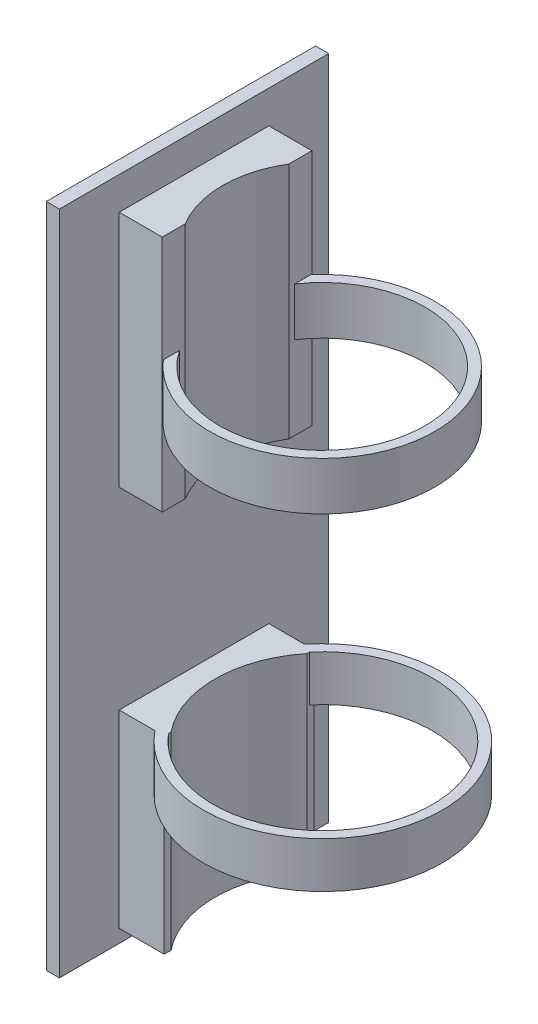
ISO-10303-21;
HEADER;
FILE_DESCRIPTION(('STEP AP214'),'2;1');
FILE_NAME('part.step','',(''),(''),'','','');
FILE_SCHEMA(('AUTOMOTIVE_DESIGN { 1 0 10303 214 1 1 1 1 }'));
ENDSEC;
DATA;
#1=APPLICATION_CONTEXT('core data for automotive mechanical design processes');
#2=APPLICATION_PROTOCOL_DEFINITION('international standard','automotive_design',2000,#1);
#3=PRODUCT_CONTEXT('',#1,'mechanical');
#4=PRODUCT('Part','Part','',(#3));
#5=PRODUCT_RELATED_PRODUCT_CATEGORY('part','',(#4));
#6=PRODUCT_DEFINITION_FORMATION('','',#4);
#7=PRODUCT_DEFINITION_CONTEXT('part definition',#1,'design');
#8=PRODUCT_DEFINITION('design','',#6,#7);
#9=PRODUCT_DEFINITION_SHAPE('','',#8);
#10=(LENGTH_UNIT() NAMED_UNIT(*) SI_UNIT(.MILLI.,.METRE.));
#11=(NAMED_UNIT(*) PLANE_ANGLE_UNIT() SI_UNIT($,.RADIAN.));
#12=(NAMED_UNIT(*) SI_UNIT($,.STERADIAN.) SOLID_ANGLE_UNIT());
#13=UNCERTAINTY_MEASURE_WITH_UNIT(LENGTH_MEASURE(1.E-05),#10,'distance_accuracy_value','');
#14=(GEOMETRIC_REPRESENTATION_CONTEXT(3) GLOBAL_UNCERTAINTY_ASSIGNED_CONTEXT((#13)) GLOBAL_UNIT_ASSIGNED_CONTEXT((#10,
#11,#12)) REPRESENTATION_CONTEXT('',''));
#15=CARTESIAN_POINT('',(0.,0.,0.));
#16=DIRECTION('',(0.,0.,1.));
#17=DIRECTION('',(1.,0.,0.));
#18=AXIS2_PLACEMENT_3D('',#15,#16,#17);
#19=CARTESIAN_POINT('',(-28.6071268948191,0.,11.43));
#20=DIRECTION('',(-1.,0.,0.));
#21=DIRECTION('',(0.,0.,1.));
#22=AXIS2_PLACEMENT_3D('',#19,#20,#21);
#23=PLANE('',#22);
#24=DIRECTION('',(0.,0.,-1.));
#25=VECTOR('',#24,1.);
#26=CARTESIAN_POINT('',(-28.6071268948191,-2.80236584326087,11.43));
#27=LINE('',#26,#25);
#28=CARTESIAN_POINT('',(-28.6071268948191,-2.80236584326087,11.43));
#29=VERTEX_POINT('',#28);
#30=CARTESIAN_POINT('',(-28.6071268948191,-2.80236584326087,10.7807490814345));
#31=VERTEX_POINT('',#30);
#32=EDGE_CURVE('E262',#29,#31,#27,.T.);
#33=ORIENTED_EDGE('',*,*,#32,.F.);
#34=DIRECTION('',(0.,1.,0.));
#35=VECTOR('',#34,1.);
#36=CARTESIAN_POINT('',(-28.6071268948191,0.,11.43));
#37=LINE('',#36,#35);
#38=CARTESIAN_POINT('',(-28.6071268948191,-24.6959497812609,11.43));
#39=VERTEX_POINT('',#38);
#40=EDGE_CURVE('E371',#39,#29,#37,.T.);
#41=ORIENTED_EDGE('',*,*,#40,.F.);
#42=DIRECTION('',(0.,0.,-1.));
#43=VECTOR('',#42,1.);
#44=CARTESIAN_POINT('',(-28.6071268948191,-24.6959497812609,11.43));
#45=LINE('',#44,#43);
#46=CARTESIAN_POINT('',(-28.6071268948191,-24.6959497812609,10.3709124643341));
#47=VERTEX_POINT('',#46);
#48=EDGE_CURVE('E224',#39,#47,#45,.T.);
#49=ORIENTED_EDGE('',*,*,#48,.T.);
#50=DIRECTION('',(0.,-1.,0.));
#51=VECTOR('',#50,1.);
#52=CARTESIAN_POINT('',(-28.6071268948191,75.0679178019088,10.3709124643341));
#53=LINE('',#52,#51);
#54=CARTESIAN_POINT('',(-28.6071268948191,4.19763415673913,10.3709124643341));
#55=VERTEX_POINT('',#54);
#56=EDGE_CURVE('E221',#55,#47,#53,.T.);
#57=ORIENTED_EDGE('',*,*,#56,.F.);
#58=DIRECTION('',(0.,0.,-1.));
#59=VECTOR('',#58,1.);
#60=CARTESIAN_POINT('',(-28.6071268948191,4.19763415673913,11.43));
#61=LINE('',#60,#59);
#62=CARTESIAN_POINT('',(-28.6071268948191,4.19763415673913,10.7807490814345));
#63=VERTEX_POINT('',#62);
#64=EDGE_CURVE('E215',#63,#55,#61,.T.);
#65=ORIENTED_EDGE('',*,*,#64,.F.);
#66=DIRECTION('',(0.,1.,0.));
#67=VECTOR('',#66,1.);
#68=CARTESIAN_POINT('',(-28.6071268948191,-2.80236584326087,10.7807490814345));
#69=LINE('',#68,#67);
#70=EDGE_CURVE('E200',#31,#63,#69,.T.);
#71=ORIENTED_EDGE('',*,*,#70,.F.);
#72=EDGE_LOOP('',(#33,#41,#49,#57,#65,#71));
#73=FACE_BOUND('',#72,.T.);
#74=ADVANCED_FACE('F39',(#73),#23,.F.);
#75=DIRECTION('',(0.,0.,-1.));
#76=VECTOR('',#75,1.);
#77=CARTESIAN_POINT('',(-28.6071268948191,-2.80236584326087,11.43));
#78=LINE('',#77,#76);
#79=CARTESIAN_POINT('',(-28.6071268948191,-2.80236584326087,-10.7807490814345));
#80=VERTEX_POINT('',#79);
#81=CARTESIAN_POINT('',(-28.6071268948191,-2.80236584326087,-11.43));
#82=VERTEX_POINT('',#81);
#83=EDGE_CURVE('E54',#80,#82,#78,.T.);
#84=ORIENTED_EDGE('',*,*,#83,.F.);
#85=DIRECTION('',(0.,1.,0.));
#86=VECTOR('',#85,1.);
#87=CARTESIAN_POINT('',(-28.6071268948191,-2.80236584326087,-10.7807490814345));
#88=LINE('',#87,#86);
#89=CARTESIAN_POINT('',(-28.6071268948191,4.19763415673913,-10.7807490814345));
#90=VERTEX_POINT('',#89);
#91=EDGE_CURVE('E58',#90,#80,#88,.F.);
#92=ORIENTED_EDGE('',*,*,#91,.F.);
#93=CARTESIAN_POINT('',(-28.6071268948191,4.19763415673913,-10.3709124643341));
#94=VERTEX_POINT('',#93);
#95=EDGE_CURVE('E217',#94,#90,#61,.T.);
#96=ORIENTED_EDGE('',*,*,#95,.F.);
#97=DIRECTION('',(0.,-1.,0.));
#98=VECTOR('',#97,1.);
#99=CARTESIAN_POINT('',(-28.6071268948191,75.0679178019088,-10.3709124643341));
#100=LINE('',#99,#98);
#101=CARTESIAN_POINT('',(-28.6071268948191,-24.6959497812609,-10.3709124643341));
#102=VERTEX_POINT('',#101);
#103=EDGE_CURVE('E297',#102,#94,#100,.F.);
#104=ORIENTED_EDGE('',*,*,#103,.F.);
#105=CARTESIAN_POINT('',(-28.6071268948191,-24.6959497812609,-11.43));
#106=VERTEX_POINT('',#105);
#107=EDGE_CURVE('E222',#102,#106,#45,.T.);
#108=ORIENTED_EDGE('',*,*,#107,.T.);
#109=DIRECTION('',(0.,1.,0.));
#110=VECTOR('',#109,1.);
#111=CARTESIAN_POINT('',(-28.6071268948191,0.,-11.43));
#112=LINE('',#111,#110);
#113=EDGE_CURVE('E384',#106,#82,#112,.T.);
#114=ORIENTED_EDGE('',*,*,#113,.T.);
#115=EDGE_LOOP('',(#84,#92,#96,#104,#108,#114));
#116=FACE_BOUND('',#115,.T.);
#117=ADVANCED_FACE('F407',(#116),#23,.F.);
#118=CARTESIAN_POINT('',(-28.9024604068047,0.,11.43));
#119=DIRECTION('',(-1.,0.,0.));
#120=DIRECTION('',(0.,0.,1.));
#121=AXIS2_PLACEMENT_3D('',#118,#119,#120);
#122=PLANE('',#121);
#123=DIRECTION('',(0.,0.,1.));
#124=VECTOR('',#123,1.);
#125=CARTESIAN_POINT('',(-28.9024604068047,53.7453987122624,11.43));
#126=LINE('',#125,#124);
#127=CARTESIAN_POINT('',(-28.9024604068047,53.7453987122624,-11.2636945327213));
#128=VERTEX_POINT('',#127);
#129=CARTESIAN_POINT('',(-28.9024604068047,53.7453987122624,-8.80203466980536));
#130=VERTEX_POINT('',#129);
#131=EDGE_CURVE('E282',#128,#130,#126,.T.);
#132=ORIENTED_EDGE('',*,*,#131,.F.);
#133=DIRECTION('',(0.,-1.,0.));
#134=VECTOR('',#133,1.);
#135=CARTESIAN_POINT('',(-28.9024604068047,53.7453987122624,-11.2636945327213));
#136=LINE('',#135,#134);
#137=CARTESIAN_POINT('',(-28.9024604068047,46.3793987122623,-11.2636945327213));
#138=VERTEX_POINT('',#137);
#139=EDGE_CURVE('E285',#128,#138,#136,.T.);
#140=ORIENTED_EDGE('',*,*,#139,.T.);
#141=DIRECTION('',(0.,0.,1.));
#142=VECTOR('',#141,1.);
#143=CARTESIAN_POINT('',(-28.9024604068047,46.3793987122623,11.43));
#144=LINE('',#143,#142);
#145=CARTESIAN_POINT('',(-28.9024604068047,46.3793987122623,-8.80203466980536));
#146=VERTEX_POINT('',#145);
#147=EDGE_CURVE('E280',#138,#146,#144,.T.);
#148=ORIENTED_EDGE('',*,*,#147,.T.);
#149=DIRECTION('',(0.,-1.,0.));
#150=VECTOR('',#149,1.);
#151=CARTESIAN_POINT('',(-28.9024604068047,53.7453987122624,-8.80203466980536));
#152=LINE('',#151,#150);
#153=EDGE_CURVE('E275',#130,#146,#152,.T.);
#154=ORIENTED_EDGE('',*,*,#153,.F.);
#155=EDGE_LOOP('',(#132,#140,#148,#154));
#156=FACE_BOUND('',#155,.T.);
#157=DIRECTION('',(0.,0.,-1.));
#158=VECTOR('',#157,1.);
#159=CARTESIAN_POINT('',(-28.9024604068047,70.0669178019088,11.43));
#160=LINE('',#159,#158);
#161=CARTESIAN_POINT('',(-28.9024604068047,70.0669178019088,-7.92289008216544));
#162=VERTEX_POINT('',#161);
#163=CARTESIAN_POINT('',(-28.9024604068047,70.0669178019088,-11.43));
#164=VERTEX_POINT('',#163);
#165=EDGE_CURVE('E330',#162,#164,#160,.T.);
#166=ORIENTED_EDGE('',*,*,#165,.F.);
#167=DIRECTION('',(0.,-1.,0.));
#168=VECTOR('',#167,1.);
#169=CARTESIAN_POINT('',(-28.9024604068047,75.0679178019088,-7.92289008216544));
#170=LINE('',#169,#168);
#171=CARTESIAN_POINT('',(-28.9024604068047,33.6793987122623,-7.92289008216544));
#172=VERTEX_POINT('',#171);
#173=EDGE_CURVE('E289',#172,#162,#170,.F.);
#174=ORIENTED_EDGE('',*,*,#173,.F.);
#175=DIRECTION('',(0.,0.,-1.));
#176=VECTOR('',#175,1.);
#177=CARTESIAN_POINT('',(-28.9024604068047,33.6793987122623,11.43));
#178=LINE('',#177,#176);
#179=CARTESIAN_POINT('',(-28.9024604068047,33.6793987122623,-11.43));
#180=VERTEX_POINT('',#179);
#181=EDGE_CURVE('E334',#172,#180,#178,.T.);
#182=ORIENTED_EDGE('',*,*,#181,.T.);
#183=DIRECTION('',(0.,1.,0.));
#184=VECTOR('',#183,1.);
#185=CARTESIAN_POINT('',(-28.9024604068047,0.,-11.43));
#186=LINE('',#185,#184);
#187=EDGE_CURVE('E318',#180,#164,#186,.T.);
#188=ORIENTED_EDGE('',*,*,#187,.T.);
#189=EDGE_LOOP('',(#166,#174,#182,#188));
#190=FACE_BOUND('',#189,.T.);
#191=ADVANCED_FACE('F424',(#156,#190),#122,.F.);
#192=CARTESIAN_POINT('',(0.,-24.6959497812609,11.43));
#193=DIRECTION('',(0.,1.,0.));
#194=DIRECTION('',(0.,0.,1.));
#195=AXIS2_PLACEMENT_3D('',#192,#193,#194);
#196=PLANE('',#195);
#197=CARTESIAN_POINT('',(-15.7738040726846,-24.6959497812609,0.));
#198=DIRECTION('',(0.,1.,0.));
#199=DIRECTION('',(0.,0.,1.));
#200=AXIS2_PLACEMENT_3D('',#197,#198,#199);
#201=CIRCLE('',#200,16.5);
#202=EDGE_CURVE('E301',#47,#102,#201,.F.);
#203=ORIENTED_EDGE('',*,*,#202,.F.);
#204=ORIENTED_EDGE('',*,*,#48,.F.);
#205=DIRECTION('',(1.,0.,0.));
#206=VECTOR('',#205,1.);
#207=CARTESIAN_POINT('',(0.,-24.6959497812609,11.43));
#208=LINE('',#207,#206);
#209=CARTESIAN_POINT('',(-35.4738040726846,-24.6959497812609,11.43));
#210=VERTEX_POINT('',#209);
#211=EDGE_CURVE('E368',#210,#39,#208,.T.);
#212=ORIENTED_EDGE('',*,*,#211,.F.);
#213=DIRECTION('',(0.,0.,-1.));
#214=VECTOR('',#213,1.);
#215=CARTESIAN_POINT('',(-35.4738040726846,-24.6959497812609,11.43));
#216=LINE('',#215,#214);
#217=CARTESIAN_POINT('',(-35.4738040726846,-24.6959497812609,-11.43));
#218=VERTEX_POINT('',#217);
#219=EDGE_CURVE('E381',#210,#218,#216,.T.);
#220=ORIENTED_EDGE('',*,*,#219,.T.);
#221=DIRECTION('',(1.,0.,0.));
#222=VECTOR('',#221,1.);
#223=CARTESIAN_POINT('',(0.,-24.6959497812609,-11.43));
#224=LINE('',#223,#222);
#225=EDGE_CURVE('E367',#218,#106,#224,.T.);
#226=ORIENTED_EDGE('',*,*,#225,.T.);
#227=ORIENTED_EDGE('',*,*,#107,.F.);
#228=EDGE_LOOP('',(#203,#204,#212,#220,#226,#227));
#229=FACE_BOUND('',#228,.T.);
#230=ADVANCED_FACE('F41',(#229),#196,.F.);
#231=CARTESIAN_POINT('',(0.,4.19763415673913,11.43));
#232=DIRECTION('',(0.,1.,0.));
#233=DIRECTION('',(0.,0.,1.));
#234=AXIS2_PLACEMENT_3D('',#231,#232,#233);
#235=PLANE('',#234);
#236=CARTESIAN_POINT('',(-15.7876904726846,4.19763415673913,0.));
#237=DIRECTION('',(0.,1.,0.));
#238=DIRECTION('',(0.,0.,1.));
#239=AXIS2_PLACEMENT_3D('',#236,#237,#238);
#240=CIRCLE('',#239,16.750000028);
#241=EDGE_CURVE('E203',#63,#90,#240,.T.);
#242=ORIENTED_EDGE('',*,*,#241,.F.);
#243=ORIENTED_EDGE('',*,*,#64,.T.);
#244=CARTESIAN_POINT('',(-15.7738040726846,4.19763415673913,0.));
#245=DIRECTION('',(0.,1.,0.));
#246=DIRECTION('',(0.,0.,1.));
#247=AXIS2_PLACEMENT_3D('',#244,#245,#246);
#248=CIRCLE('',#247,16.5);
#249=EDGE_CURVE('E299',#55,#94,#248,.F.);
#250=ORIENTED_EDGE('',*,*,#249,.T.);
#251=ORIENTED_EDGE('',*,*,#95,.T.);
#252=EDGE_LOOP('',(#242,#243,#250,#251));
#253=FACE_BOUND('',#252,.T.);
#254=DIRECTION('',(1.,0.,0.));
#255=VECTOR('',#254,1.);
#256=CARTESIAN_POINT('',(0.,4.19763415673913,11.43));
#257=LINE('',#256,#255);
#258=CARTESIAN_POINT('',(-35.4738040726846,4.19763415673913,11.43));
#259=VERTEX_POINT('',#258);
#260=CARTESIAN_POINT('',(-30.0150444438909,4.19763415673913,11.43));
#261=VERTEX_POINT('',#260);
#262=EDGE_CURVE('E375',#259,#261,#257,.T.);
#263=ORIENTED_EDGE('',*,*,#262,.T.);
#264=CARTESIAN_POINT('',(-15.7876904726846,4.19763415673913,0.));
#265=DIRECTION('',(0.,1.,0.));
#266=DIRECTION('',(0.,0.,1.));
#267=AXIS2_PLACEMENT_3D('',#264,#265,#266);
#268=CIRCLE('',#267,18.250000028);
#269=CARTESIAN_POINT('',(-30.0150444438909,4.19763415673913,-11.43));
#270=VERTEX_POINT('',#269);
#271=EDGE_CURVE('E254',#261,#270,#268,.T.);
#272=ORIENTED_EDGE('',*,*,#271,.T.);
#273=DIRECTION('',(1.,0.,0.));
#274=VECTOR('',#273,1.);
#275=CARTESIAN_POINT('',(0.,4.19763415673913,-11.43));
#276=LINE('',#275,#274);
#277=CARTESIAN_POINT('',(-35.4738040726846,4.19763415673913,-11.43));
#278=VERTEX_POINT('',#277);
#279=EDGE_CURVE('E386',#278,#270,#276,.T.);
#280=ORIENTED_EDGE('',*,*,#279,.F.);
#281=DIRECTION('',(0.,0.,-1.));
#282=VECTOR('',#281,1.);
#283=CARTESIAN_POINT('',(-35.4738040726846,4.19763415673913,11.43));
#284=LINE('',#283,#282);
#285=EDGE_CURVE('E226',#259,#278,#284,.T.);
#286=ORIENTED_EDGE('',*,*,#285,.F.);
#287=EDGE_LOOP('',(#263,#272,#280,#286));
#288=FACE_BOUND('',#287,.T.);
#289=ADVANCED_FACE('F212',(#253,#288),#235,.T.);
#290=CARTESIAN_POINT('',(0.,0.,11.43));
#291=DIRECTION('',(0.,0.,1.));
#292=DIRECTION('',(1.,0.,0.));
#293=AXIS2_PLACEMENT_3D('',#290,#291,#292);
#294=PLANE('',#293);
#295=DIRECTION('',(0.,1.,0.));
#296=VECTOR('',#295,1.);
#297=CARTESIAN_POINT('',(-30.0150444438909,-2.80236584326087,11.43));
#298=LINE('',#297,#296);
#299=CARTESIAN_POINT('',(-30.0150444438909,-2.80236584326087,11.43));
#300=VERTEX_POINT('',#299);
#301=EDGE_CURVE('E253',#261,#300,#298,.F.);
#302=ORIENTED_EDGE('',*,*,#301,.F.);
#303=ORIENTED_EDGE('',*,*,#262,.F.);
#304=DIRECTION('',(0.,1.,0.));
#305=VECTOR('',#304,1.);
#306=CARTESIAN_POINT('',(-35.4738040726846,0.,11.43));
#307=LINE('',#306,#305);
#308=EDGE_CURVE('E378',#210,#259,#307,.T.);
#309=ORIENTED_EDGE('',*,*,#308,.F.);
#310=ORIENTED_EDGE('',*,*,#211,.T.);
#311=ORIENTED_EDGE('',*,*,#40,.T.);
#312=DIRECTION('',(-1.,0.,0.));
#313=VECTOR('',#312,1.);
#314=CARTESIAN_POINT('',(0.,-2.80236584326087,11.43));
#315=LINE('',#314,#313);
#316=EDGE_CURVE('E256',#29,#300,#315,.T.);
#317=ORIENTED_EDGE('',*,*,#316,.T.);
#318=EDGE_LOOP('',(#302,#303,#309,#310,#311,#317));
#319=FACE_BOUND('',#318,.T.);
#320=ADVANCED_FACE('F400',(#319),#294,.T.);
#321=CARTESIAN_POINT('',(0.,0.,-11.43));
#322=DIRECTION('',(0.,0.,1.));
#323=DIRECTION('',(1.,0.,0.));
#324=AXIS2_PLACEMENT_3D('',#321,#322,#323);
#325=PLANE('',#324);
#326=ORIENTED_EDGE('',*,*,#279,.T.);
#327=DIRECTION('',(0.,1.,0.));
#328=VECTOR('',#327,1.);
#329=CARTESIAN_POINT('',(-30.0150444438909,-2.80236584326087,-11.43));
#330=LINE('',#329,#328);
#331=CARTESIAN_POINT('',(-30.0150444438909,-2.80236584326087,-11.43));
#332=VERTEX_POINT('',#331);
#333=EDGE_CURVE('E11',#270,#332,#330,.F.);
#334=ORIENTED_EDGE('',*,*,#333,.T.);
#335=DIRECTION('',(-1.,0.,0.));
#336=VECTOR('',#335,1.);
#337=CARTESIAN_POINT('',(0.,-2.80236584326087,-11.43));
#338=LINE('',#337,#336);
#339=EDGE_CURVE('E47',#82,#332,#338,.T.);
#340=ORIENTED_EDGE('',*,*,#339,.F.);
#341=ORIENTED_EDGE('',*,*,#113,.F.);
#342=ORIENTED_EDGE('',*,*,#225,.F.);
#343=DIRECTION('',(0.,1.,0.));
#344=VECTOR('',#343,1.);
#345=CARTESIAN_POINT('',(-35.4738040726846,0.,-11.43));
#346=LINE('',#345,#344);
#347=EDGE_CURVE('E372',#218,#278,#346,.T.);
#348=ORIENTED_EDGE('',*,*,#347,.T.);
#349=EDGE_LOOP('',(#326,#334,#340,#341,#342,#348));
#350=FACE_BOUND('',#349,.T.);
#351=ADVANCED_FACE('F408',(#350),#325,.F.);
#352=CARTESIAN_POINT('',(0.,-26.6959497812609,20.574));
#353=DIRECTION('',(0.,-1.,0.));
#354=DIRECTION('',(0.,0.,-1.));
#355=AXIS2_PLACEMENT_3D('',#352,#353,#354);
#356=PLANE('',#355);
#357=DIRECTION('',(-1.,0.,0.));
#358=VECTOR('',#357,1.);
#359=CARTESIAN_POINT('',(0.,-26.6959497812609,-20.574));
#360=LINE('',#359,#358);
#361=CARTESIAN_POINT('',(-35.4738040726846,-26.6959497812609,-20.574));
#362=VERTEX_POINT('',#361);
#363=CARTESIAN_POINT('',(-37.4738040726846,-26.6959497812609,-20.574));
#364=VERTEX_POINT('',#363);
#365=EDGE_CURVE('E338',#362,#364,#360,.T.);
#366=ORIENTED_EDGE('',*,*,#365,.F.);
#367=DIRECTION('',(0.,0.,-1.));
#368=VECTOR('',#367,1.);
#369=CARTESIAN_POINT('',(-35.4738040726846,-26.6959497812609,20.574));
#370=LINE('',#369,#368);
#371=CARTESIAN_POINT('',(-35.4738040726846,-26.6959497812609,20.574));
#372=VERTEX_POINT('',#371);
#373=EDGE_CURVE('E365',#372,#362,#370,.T.);
#374=ORIENTED_EDGE('',*,*,#373,.F.);
#375=DIRECTION('',(-1.,0.,0.));
#376=VECTOR('',#375,1.);
#377=CARTESIAN_POINT('',(0.,-26.6959497812609,20.574));
#378=LINE('',#377,#376);
#379=CARTESIAN_POINT('',(-37.4738040726846,-26.6959497812609,20.574));
#380=VERTEX_POINT('',#379);
#381=EDGE_CURVE('E339',#372,#380,#378,.T.);
#382=ORIENTED_EDGE('',*,*,#381,.T.);
#383=DIRECTION('',(0.,0.,-1.));
#384=VECTOR('',#383,1.);
#385=CARTESIAN_POINT('',(-37.4738040726846,-26.6959497812609,20.574));
#386=LINE('',#385,#384);
#387=EDGE_CURVE('E349',#380,#364,#386,.T.);
#388=ORIENTED_EDGE('',*,*,#387,.T.);
#389=EDGE_LOOP('',(#366,#374,#382,#388));
#390=FACE_BOUND('',#389,.T.);
#391=ADVANCED_FACE('F410',(#390),#356,.T.);
#392=CARTESIAN_POINT('',(-35.4738040726846,0.,20.574));
#393=DIRECTION('',(-1.,0.,0.));
#394=DIRECTION('',(0.,0.,1.));
#395=AXIS2_PLACEMENT_3D('',#392,#393,#394);
#396=PLANE('',#395);
#397=DIRECTION('',(0.,0.,-1.));
#398=VECTOR('',#397,1.);
#399=CARTESIAN_POINT('',(-35.4738040726846,33.6793987122623,11.43));
#400=LINE('',#399,#398);
#401=CARTESIAN_POINT('',(-35.4738040726846,33.6793987122623,11.43));
#402=VERTEX_POINT('',#401);
#403=CARTESIAN_POINT('',(-35.4738040726846,33.6793987122623,-11.43));
#404=VERTEX_POINT('',#403);
#405=EDGE_CURVE('E315',#402,#404,#400,.T.);
#406=ORIENTED_EDGE('',*,*,#405,.F.);
#407=DIRECTION('',(0.,1.,0.));
#408=VECTOR('',#407,1.);
#409=CARTESIAN_POINT('',(-35.4738040726846,0.,11.43));
#410=LINE('',#409,#408);
#411=CARTESIAN_POINT('',(-35.4738040726846,70.0669178019088,11.43));
#412=VERTEX_POINT('',#411);
#413=EDGE_CURVE('E313',#402,#412,#410,.T.);
#414=ORIENTED_EDGE('',*,*,#413,.T.);
#415=DIRECTION('',(0.,0.,-1.));
#416=VECTOR('',#415,1.);
#417=CARTESIAN_POINT('',(-35.4738040726846,70.0669178019088,11.43));
#418=LINE('',#417,#416);
#419=CARTESIAN_POINT('',(-35.4738040726846,70.0669178019088,-11.43));
#420=VERTEX_POINT('',#419);
#421=EDGE_CURVE('E328',#412,#420,#418,.T.);
#422=ORIENTED_EDGE('',*,*,#421,.T.);
#423=DIRECTION('',(0.,1.,0.));
#424=VECTOR('',#423,1.);
#425=CARTESIAN_POINT('',(-35.4738040726846,0.,-11.43));
#426=LINE('',#425,#424);
#427=EDGE_CURVE('E308',#404,#420,#426,.T.);
#428=ORIENTED_EDGE('',*,*,#427,.F.);
#429=EDGE_LOOP('',(#406,#414,#422,#428));
#430=FACE_BOUND('',#429,.T.);
#431=ORIENTED_EDGE('',*,*,#347,.F.);
#432=ORIENTED_EDGE('',*,*,#219,.F.);
#433=ORIENTED_EDGE('',*,*,#308,.T.);
#434=ORIENTED_EDGE('',*,*,#285,.T.);
#435=EDGE_LOOP('',(#431,#432,#433,#434));
#436=FACE_BOUND('',#435,.T.);
#437=DIRECTION('',(0.,1.,0.));
#438=VECTOR('',#437,1.);
#439=CARTESIAN_POINT('',(-35.4738040726846,0.,-20.574));
#440=LINE('',#439,#438);
#441=CARTESIAN_POINT('',(-35.4738040726846,75.0669178019088,-20.574));
#442=VERTEX_POINT('',#441);
#443=EDGE_CURVE('E352',#362,#442,#440,.T.);
#444=ORIENTED_EDGE('',*,*,#443,.T.);
#445=DIRECTION('',(0.,0.,-1.));
#446=VECTOR('',#445,1.);
#447=CARTESIAN_POINT('',(-35.4738040726846,75.0669178019088,20.574));
#448=LINE('',#447,#446);
#449=CARTESIAN_POINT('',(-35.4738040726846,75.0669178019088,20.574));
#450=VERTEX_POINT('',#449);
#451=EDGE_CURVE('E362',#450,#442,#448,.T.);
#452=ORIENTED_EDGE('',*,*,#451,.F.);
#453=DIRECTION('',(0.,1.,0.));
#454=VECTOR('',#453,1.);
#455=CARTESIAN_POINT('',(-35.4738040726846,0.,20.574));
#456=LINE('',#455,#454);
#457=EDGE_CURVE('E342',#372,#450,#456,.T.);
#458=ORIENTED_EDGE('',*,*,#457,.F.);
#459=ORIENTED_EDGE('',*,*,#373,.T.);
#460=EDGE_LOOP('',(#444,#452,#458,#459));
#461=FACE_BOUND('',#460,.T.);
#462=ADVANCED_FACE('F394',(#430,#436,#461),#396,.F.);
#463=CARTESIAN_POINT('',(0.,75.0669178019088,20.574));
#464=DIRECTION('',(0.,-1.,0.));
#465=DIRECTION('',(0.,0.,-1.));
#466=AXIS2_PLACEMENT_3D('',#463,#464,#465);
#467=PLANE('',#466);
#468=DIRECTION('',(-1.,0.,0.));
#469=VECTOR('',#468,1.);
#470=CARTESIAN_POINT('',(0.,75.0669178019088,-20.574));
#471=LINE('',#470,#469);
#472=CARTESIAN_POINT('',(-37.4738040726846,75.0669178019088,-20.574));
#473=VERTEX_POINT('',#472);
#474=EDGE_CURVE('E354',#442,#473,#471,.T.);
#475=ORIENTED_EDGE('',*,*,#474,.T.);
#476=DIRECTION('',(0.,0.,-1.));
#477=VECTOR('',#476,1.);
#478=CARTESIAN_POINT('',(-37.4738040726846,75.0669178019088,20.574));
#479=LINE('',#478,#477);
#480=CARTESIAN_POINT('',(-37.4738040726846,75.0669178019088,20.574));
#481=VERTEX_POINT('',#480);
#482=EDGE_CURVE('E359',#481,#473,#479,.T.);
#483=ORIENTED_EDGE('',*,*,#482,.F.);
#484=DIRECTION('',(-1.,0.,0.));
#485=VECTOR('',#484,1.);
#486=CARTESIAN_POINT('',(0.,75.0669178019088,20.574));
#487=LINE('',#486,#485);
#488=EDGE_CURVE('E345',#450,#481,#487,.T.);
#489=ORIENTED_EDGE('',*,*,#488,.F.);
#490=ORIENTED_EDGE('',*,*,#451,.T.);
#491=EDGE_LOOP('',(#475,#483,#489,#490));
#492=FACE_BOUND('',#491,.T.);
#493=ADVANCED_FACE('F620',(#492),#467,.F.);
#494=CARTESIAN_POINT('',(-37.4738040726846,0.,20.574));
#495=DIRECTION('',(1.,0.,0.));
#496=DIRECTION('',(0.,1.,0.));
#497=AXIS2_PLACEMENT_3D('',#494,#495,#496);
#498=PLANE('',#497);
#499=DIRECTION('',(0.,-1.,0.));
#500=VECTOR('',#499,1.);
#501=CARTESIAN_POINT('',(-37.4738040726846,0.,-20.574));
#502=LINE('',#501,#500);
#503=EDGE_CURVE('E343',#473,#364,#502,.T.);
#504=ORIENTED_EDGE('',*,*,#503,.T.);
#505=ORIENTED_EDGE('',*,*,#387,.F.);
#506=DIRECTION('',(0.,-1.,0.));
#507=VECTOR('',#506,1.);
#508=CARTESIAN_POINT('',(-37.4738040726846,0.,20.574));
#509=LINE('',#508,#507);
#510=EDGE_CURVE('E347',#481,#380,#509,.T.);
#511=ORIENTED_EDGE('',*,*,#510,.F.);
#512=ORIENTED_EDGE('',*,*,#482,.T.);
#513=EDGE_LOOP('',(#504,#505,#511,#512));
#514=FACE_BOUND('',#513,.T.);
#515=ADVANCED_FACE('F610',(#514),#498,.F.);
#516=CARTESIAN_POINT('',(0.,0.,20.574));
#517=DIRECTION('',(0.,0.,1.));
#518=DIRECTION('',(1.,0.,0.));
#519=AXIS2_PLACEMENT_3D('',#516,#517,#518);
#520=PLANE('',#519);
#521=ORIENTED_EDGE('',*,*,#381,.F.);
#522=ORIENTED_EDGE('',*,*,#457,.T.);
#523=ORIENTED_EDGE('',*,*,#488,.T.);
#524=ORIENTED_EDGE('',*,*,#510,.T.);
#525=EDGE_LOOP('',(#521,#522,#523,#524));
#526=FACE_BOUND('',#525,.T.);
#527=ADVANCED_FACE('F600',(#526),#520,.T.);
#528=CARTESIAN_POINT('',(0.,0.,-20.574));
#529=DIRECTION('',(0.,0.,1.));
#530=DIRECTION('',(1.,0.,0.));
#531=AXIS2_PLACEMENT_3D('',#528,#529,#530);
#532=PLANE('',#531);
#533=ORIENTED_EDGE('',*,*,#365,.T.);
#534=ORIENTED_EDGE('',*,*,#503,.F.);
#535=ORIENTED_EDGE('',*,*,#474,.F.);
#536=ORIENTED_EDGE('',*,*,#443,.F.);
#537=EDGE_LOOP('',(#533,#534,#535,#536));
#538=FACE_BOUND('',#537,.T.);
#539=ADVANCED_FACE('F450',(#538),#532,.F.);
#540=CARTESIAN_POINT('',(0.,33.6793987122623,11.43));
#541=DIRECTION('',(0.,1.,0.));
#542=DIRECTION('',(0.,0.,1.));
#543=AXIS2_PLACEMENT_3D('',#540,#541,#542);
#544=PLANE('',#543);
#545=ORIENTED_EDGE('',*,*,#181,.F.);
#546=CARTESIAN_POINT('',(-15.8838040726846,33.6793987122623,0.));
#547=DIRECTION('',(0.,-1.,0.));
#548=DIRECTION('',(0.,0.,-1.));
#549=AXIS2_PLACEMENT_3D('',#546,#547,#548);
#550=CIRCLE('',#549,15.24);
#551=CARTESIAN_POINT('',(-28.9024604068047,33.6793987122623,7.92289008216544));
#552=VERTEX_POINT('',#551);
#553=EDGE_CURVE('E291',#552,#172,#550,.T.);
#554=ORIENTED_EDGE('',*,*,#553,.F.);
#555=CARTESIAN_POINT('',(-28.9024604068047,33.6793987122623,11.43));
#556=VERTEX_POINT('',#555);
#557=EDGE_CURVE('E335',#556,#552,#178,.T.);
#558=ORIENTED_EDGE('',*,*,#557,.F.);
#559=DIRECTION('',(1.,0.,0.));
#560=VECTOR('',#559,1.);
#561=CARTESIAN_POINT('',(0.,33.6793987122623,11.43));
#562=LINE('',#561,#560);
#563=EDGE_CURVE('E304',#402,#556,#562,.T.);
#564=ORIENTED_EDGE('',*,*,#563,.F.);
#565=ORIENTED_EDGE('',*,*,#405,.T.);
#566=DIRECTION('',(1.,0.,0.));
#567=VECTOR('',#566,1.);
#568=CARTESIAN_POINT('',(0.,33.6793987122623,-11.43));
#569=LINE('',#568,#567);
#570=EDGE_CURVE('E303',#404,#180,#569,.T.);
#571=ORIENTED_EDGE('',*,*,#570,.T.);
#572=EDGE_LOOP('',(#545,#554,#558,#564,#565,#571));
#573=FACE_BOUND('',#572,.T.);
#574=ADVANCED_FACE('F442',(#573),#544,.F.);
#575=DIRECTION('',(0.,0.,1.));
#576=VECTOR('',#575,1.);
#577=CARTESIAN_POINT('',(-28.9024604068047,46.3793987122623,11.43));
#578=LINE('',#577,#576);
#579=CARTESIAN_POINT('',(-28.9024604068047,46.3793987122623,8.80203466980536));
#580=VERTEX_POINT('',#579);
#581=CARTESIAN_POINT('',(-28.9024604068047,46.3793987122623,11.2636945327213));
#582=VERTEX_POINT('',#581);
#583=EDGE_CURVE('E233',#580,#582,#578,.T.);
#584=ORIENTED_EDGE('',*,*,#583,.T.);
#585=DIRECTION('',(0.,-1.,0.));
#586=VECTOR('',#585,1.);
#587=CARTESIAN_POINT('',(-28.9024604068047,53.7453987122624,11.2636945327213));
#588=LINE('',#587,#586);
#589=CARTESIAN_POINT('',(-28.9024604068047,53.7453987122624,11.2636945327213));
#590=VERTEX_POINT('',#589);
#591=EDGE_CURVE('E238',#582,#590,#588,.F.);
#592=ORIENTED_EDGE('',*,*,#591,.T.);
#593=DIRECTION('',(0.,0.,1.));
#594=VECTOR('',#593,1.);
#595=CARTESIAN_POINT('',(-28.9024604068047,53.7453987122624,11.43));
#596=LINE('',#595,#594);
#597=CARTESIAN_POINT('',(-28.9024604068047,53.7453987122624,8.80203466980536));
#598=VERTEX_POINT('',#597);
#599=EDGE_CURVE('E235',#598,#590,#596,.T.);
#600=ORIENTED_EDGE('',*,*,#599,.F.);
#601=DIRECTION('',(0.,-1.,0.));
#602=VECTOR('',#601,1.);
#603=CARTESIAN_POINT('',(-28.9024604068047,53.7453987122624,8.80203466980536));
#604=LINE('',#603,#602);
#605=EDGE_CURVE('E230',#580,#598,#604,.F.);
#606=ORIENTED_EDGE('',*,*,#605,.F.);
#607=EDGE_LOOP('',(#584,#592,#600,#606));
#608=FACE_BOUND('',#607,.T.);
#609=ORIENTED_EDGE('',*,*,#557,.T.);
#610=DIRECTION('',(0.,-1.,0.));
#611=VECTOR('',#610,1.);
#612=CARTESIAN_POINT('',(-28.9024604068047,75.0679178019088,7.92289008216544));
#613=LINE('',#612,#611);
#614=CARTESIAN_POINT('',(-28.9024604068047,70.0669178019088,7.92289008216544));
#615=VERTEX_POINT('',#614);
#616=EDGE_CURVE('E287',#615,#552,#613,.T.);
#617=ORIENTED_EDGE('',*,*,#616,.F.);
#618=CARTESIAN_POINT('',(-28.9024604068047,70.0669178019088,11.43));
#619=VERTEX_POINT('',#618);
#620=EDGE_CURVE('E331',#619,#615,#160,.T.);
#621=ORIENTED_EDGE('',*,*,#620,.F.);
#622=DIRECTION('',(0.,1.,0.));
#623=VECTOR('',#622,1.);
#624=CARTESIAN_POINT('',(-28.9024604068047,0.,11.43));
#625=LINE('',#624,#623);
#626=EDGE_CURVE('E307',#556,#619,#625,.T.);
#627=ORIENTED_EDGE('',*,*,#626,.F.);
#628=EDGE_LOOP('',(#609,#617,#621,#627));
#629=FACE_BOUND('',#628,.T.);
#630=ADVANCED_FACE('F434',(#608,#629),#122,.F.);
#631=CARTESIAN_POINT('',(0.,70.0669178019088,11.43));
#632=DIRECTION('',(0.,1.,0.));
#633=DIRECTION('',(0.,0.,1.));
#634=AXIS2_PLACEMENT_3D('',#631,#632,#633);
#635=PLANE('',#634);
#636=CARTESIAN_POINT('',(-15.8838040726846,70.0669178019088,0.));
#637=DIRECTION('',(0.,1.,0.));
#638=DIRECTION('',(0.,0.,1.));
#639=AXIS2_PLACEMENT_3D('',#636,#637,#638);
#640=CIRCLE('',#639,15.24);
#641=EDGE_CURVE('E293',#615,#162,#640,.F.);
#642=ORIENTED_EDGE('',*,*,#641,.T.);
#643=ORIENTED_EDGE('',*,*,#165,.T.);
#644=DIRECTION('',(1.,0.,0.));
#645=VECTOR('',#644,1.);
#646=CARTESIAN_POINT('',(0.,70.0669178019088,-11.43));
#647=LINE('',#646,#645);
#648=EDGE_CURVE('E321',#420,#164,#647,.T.);
#649=ORIENTED_EDGE('',*,*,#648,.F.);
#650=ORIENTED_EDGE('',*,*,#421,.F.);
#651=DIRECTION('',(1.,0.,0.));
#652=VECTOR('',#651,1.);
#653=CARTESIAN_POINT('',(0.,70.0669178019088,11.43));
#654=LINE('',#653,#652);
#655=EDGE_CURVE('E310',#412,#619,#654,.T.);
#656=ORIENTED_EDGE('',*,*,#655,.T.);
#657=ORIENTED_EDGE('',*,*,#620,.T.);
#658=EDGE_LOOP('',(#642,#643,#649,#650,#656,#657));
#659=FACE_BOUND('',#658,.T.);
#660=ADVANCED_FACE('F441',(#659),#635,.T.);
#661=CARTESIAN_POINT('',(0.,0.,11.43));
#662=DIRECTION('',(0.,0.,1.));
#663=DIRECTION('',(1.,0.,0.));
#664=AXIS2_PLACEMENT_3D('',#661,#662,#663);
#665=PLANE('',#664);
#666=ORIENTED_EDGE('',*,*,#563,.T.);
#667=ORIENTED_EDGE('',*,*,#626,.T.);
#668=ORIENTED_EDGE('',*,*,#655,.F.);
#669=ORIENTED_EDGE('',*,*,#413,.F.);
#670=EDGE_LOOP('',(#666,#667,#668,#669));
#671=FACE_BOUND('',#670,.T.);
#672=ADVANCED_FACE('F448',(#671),#665,.T.);
#673=CARTESIAN_POINT('',(0.,0.,-11.43));
#674=DIRECTION('',(0.,0.,1.));
#675=DIRECTION('',(1.,0.,0.));
#676=AXIS2_PLACEMENT_3D('',#673,#674,#675);
#677=PLANE('',#676);
#678=ORIENTED_EDGE('',*,*,#570,.F.);
#679=ORIENTED_EDGE('',*,*,#427,.T.);
#680=ORIENTED_EDGE('',*,*,#648,.T.);
#681=ORIENTED_EDGE('',*,*,#187,.F.);
#682=EDGE_LOOP('',(#678,#679,#680,#681));
#683=FACE_BOUND('',#682,.T.);
#684=ADVANCED_FACE('F474',(#683),#677,.F.);
#685=CARTESIAN_POINT('',(-15.7738040726846,-59.7479497812609,0.));
#686=DIRECTION('',(0.,1.,0.));
#687=DIRECTION('',(0.,0.,1.));
#688=AXIS2_PLACEMENT_3D('',#685,#686,#687);
#689=CYLINDRICAL_SURFACE('',#688,16.5);
#690=ORIENTED_EDGE('',*,*,#202,.T.);
#691=ORIENTED_EDGE('',*,*,#103,.T.);
#692=ORIENTED_EDGE('',*,*,#249,.F.);
#693=ORIENTED_EDGE('',*,*,#56,.T.);
#694=EDGE_LOOP('',(#690,#691,#692,#693));
#695=FACE_BOUND('',#694,.T.);
#696=ADVANCED_FACE('F406',(#695),#689,.F.);
#697=CARTESIAN_POINT('',(-15.8838040726846,75.0679178019088,0.));
#698=DIRECTION('',(0.,-1.,0.));
#699=DIRECTION('',(0.,0.,-1.));
#700=AXIS2_PLACEMENT_3D('',#697,#698,#699);
#701=CYLINDRICAL_SURFACE('',#700,15.24);
#702=ORIENTED_EDGE('',*,*,#173,.T.);
#703=ORIENTED_EDGE('',*,*,#641,.F.);
#704=ORIENTED_EDGE('',*,*,#616,.T.);
#705=ORIENTED_EDGE('',*,*,#553,.T.);
#706=EDGE_LOOP('',(#702,#703,#704,#705));
#707=FACE_BOUND('',#706,.T.);
#708=ADVANCED_FACE('F464',(#707),#701,.F.);
#709=CARTESIAN_POINT('',(-15.8838040726846,53.7453987122624,0.));
#710=DIRECTION('',(0.,-1.,0.));
#711=DIRECTION('',(0.,0.,-1.));
#712=AXIS2_PLACEMENT_3D('',#709,#710,#711);
#713=CYLINDRICAL_SURFACE('',#712,17.215000066);
#714=ORIENTED_EDGE('',*,*,#139,.F.);
#715=CARTESIAN_POINT('',(-15.8838040726846,53.7453987122624,0.));
#716=DIRECTION('',(0.,-1.,0.));
#717=DIRECTION('',(0.,0.,-1.));
#718=AXIS2_PLACEMENT_3D('',#715,#716,#717);
#719=CIRCLE('',#718,17.215000066);
#720=EDGE_CURVE('E272',#128,#590,#719,.T.);
#721=ORIENTED_EDGE('',*,*,#720,.T.);
#722=ORIENTED_EDGE('',*,*,#591,.F.);
#723=CARTESIAN_POINT('',(-15.8838040726846,46.3793987122623,0.));
#724=DIRECTION('',(0.,-1.,0.));
#725=DIRECTION('',(0.,0.,-1.));
#726=AXIS2_PLACEMENT_3D('',#723,#724,#725);
#727=CIRCLE('',#726,17.215000066);
#728=EDGE_CURVE('E269',#138,#582,#727,.T.);
#729=ORIENTED_EDGE('',*,*,#728,.F.);
#730=EDGE_LOOP('',(#714,#721,#722,#729));
#731=FACE_BOUND('',#730,.T.);
#732=ADVANCED_FACE('F486',(#731),#713,.T.);
#733=CARTESIAN_POINT('',(-15.8838040726846,53.7453987122624,0.));
#734=DIRECTION('',(0.,-1.,0.));
#735=DIRECTION('',(0.,0.,-1.));
#736=AXIS2_PLACEMENT_3D('',#733,#734,#735);
#737=PLANE('',#736);
#738=ORIENTED_EDGE('',*,*,#720,.F.);
#739=ORIENTED_EDGE('',*,*,#131,.T.);
#740=CARTESIAN_POINT('',(-15.8838040726846,53.7453987122624,0.));
#741=DIRECTION('',(0.,-1.,0.));
#742=DIRECTION('',(0.,0.,-1.));
#743=AXIS2_PLACEMENT_3D('',#740,#741,#742);
#744=CIRCLE('',#743,15.715000066);
#745=EDGE_CURVE('E266',#130,#598,#744,.T.);
#746=ORIENTED_EDGE('',*,*,#745,.T.);
#747=ORIENTED_EDGE('',*,*,#599,.T.);
#748=EDGE_LOOP('',(#738,#739,#746,#747));
#749=FACE_BOUND('',#748,.T.);
#750=ADVANCED_FACE('F489',(#749),#737,.F.);
#751=CARTESIAN_POINT('',(-15.8838040726846,46.3793987122623,0.));
#752=DIRECTION('',(0.,-1.,0.));
#753=DIRECTION('',(0.,0.,-1.));
#754=AXIS2_PLACEMENT_3D('',#751,#752,#753);
#755=PLANE('',#754);
#756=ORIENTED_EDGE('',*,*,#147,.F.);
#757=ORIENTED_EDGE('',*,*,#728,.T.);
#758=ORIENTED_EDGE('',*,*,#583,.F.);
#759=CARTESIAN_POINT('',(-15.8838040726846,46.3793987122623,0.));
#760=DIRECTION('',(0.,-1.,0.));
#761=DIRECTION('',(0.,0.,-1.));
#762=AXIS2_PLACEMENT_3D('',#759,#760,#761);
#763=CIRCLE('',#762,15.715000066);
#764=EDGE_CURVE('E209',#146,#580,#763,.T.);
#765=ORIENTED_EDGE('',*,*,#764,.F.);
#766=EDGE_LOOP('',(#756,#757,#758,#765));
#767=FACE_BOUND('',#766,.T.);
#768=ADVANCED_FACE('F491',(#767),#755,.T.);
#769=CARTESIAN_POINT('',(-15.8838040726846,53.7453987122624,0.));
#770=DIRECTION('',(0.,-1.,0.));
#771=DIRECTION('',(0.,0.,-1.));
#772=AXIS2_PLACEMENT_3D('',#769,#770,#771);
#773=CYLINDRICAL_SURFACE('',#772,15.715000066);
#774=ORIENTED_EDGE('',*,*,#745,.F.);
#775=ORIENTED_EDGE('',*,*,#153,.T.);
#776=ORIENTED_EDGE('',*,*,#764,.T.);
#777=ORIENTED_EDGE('',*,*,#605,.T.);
#778=EDGE_LOOP('',(#774,#775,#776,#777));
#779=FACE_BOUND('',#778,.T.);
#780=ADVANCED_FACE('F494',(#779),#773,.F.);
#781=CARTESIAN_POINT('',(-15.7876904726846,-2.80236584326087,0.));
#782=DIRECTION('',(0.,1.,0.));
#783=DIRECTION('',(0.,0.,1.));
#784=AXIS2_PLACEMENT_3D('',#781,#782,#783);
#785=CYLINDRICAL_SURFACE('',#784,16.750000028);
#786=CARTESIAN_POINT('',(-15.7876904726846,-2.80236584326087,0.));
#787=DIRECTION('',(0.,1.,0.));
#788=DIRECTION('',(0.,0.,1.));
#789=AXIS2_PLACEMENT_3D('',#786,#787,#788);
#790=CIRCLE('',#789,16.750000028);
#791=EDGE_CURVE('E205',#31,#80,#790,.T.);
#792=ORIENTED_EDGE('',*,*,#791,.F.);
#793=ORIENTED_EDGE('',*,*,#70,.T.);
#794=ORIENTED_EDGE('',*,*,#241,.T.);
#795=ORIENTED_EDGE('',*,*,#91,.T.);
#796=EDGE_LOOP('',(#792,#793,#794,#795));
#797=FACE_BOUND('',#796,.T.);
#798=ADVANCED_FACE('F202',(#797),#785,.F.);
#799=CARTESIAN_POINT('',(-15.7876904726846,-2.80236584326087,0.));
#800=DIRECTION('',(0.,1.,0.));
#801=DIRECTION('',(0.,0.,1.));
#802=AXIS2_PLACEMENT_3D('',#799,#800,#801);
#803=PLANE('',#802);
#804=ORIENTED_EDGE('',*,*,#316,.F.);
#805=ORIENTED_EDGE('',*,*,#32,.T.);
#806=ORIENTED_EDGE('',*,*,#791,.T.);
#807=ORIENTED_EDGE('',*,*,#83,.T.);
#808=ORIENTED_EDGE('',*,*,#339,.T.);
#809=CARTESIAN_POINT('',(-15.7876904726846,-2.80236584326087,0.));
#810=DIRECTION('',(0.,1.,0.));
#811=DIRECTION('',(0.,0.,1.));
#812=AXIS2_PLACEMENT_3D('',#809,#810,#811);
#813=CIRCLE('',#812,18.250000028);
#814=EDGE_CURVE('E244',#300,#332,#813,.T.);
#815=ORIENTED_EDGE('',*,*,#814,.F.);
#816=EDGE_LOOP('',(#804,#805,#806,#807,#808,#815));
#817=FACE_BOUND('',#816,.T.);
#818=ADVANCED_FACE('F243',(#817),#803,.F.);
#819=CARTESIAN_POINT('',(-15.7876904726846,-2.80236584326087,0.));
#820=DIRECTION('',(0.,1.,0.));
#821=DIRECTION('',(0.,0.,1.));
#822=AXIS2_PLACEMENT_3D('',#819,#820,#821);
#823=CYLINDRICAL_SURFACE('',#822,18.250000028);
#824=ORIENTED_EDGE('',*,*,#271,.F.);
#825=ORIENTED_EDGE('',*,*,#301,.T.);
#826=ORIENTED_EDGE('',*,*,#814,.T.);
#827=ORIENTED_EDGE('',*,*,#333,.F.);
#828=EDGE_LOOP('',(#824,#825,#826,#827));
#829=FACE_BOUND('',#828,.T.);
#830=ADVANCED_FACE('F250',(#829),#823,.T.);
#831=CLOSED_SHELL('',(#74,#117,#191,#230,#289,#320,#351,#391,#462,#493,#515,#527,#539,#574,#630,
#660,#672,#684,#696,#708,#732,#750,#768,#780,#798,#818,#830));
#832=MANIFOLD_SOLID_BREP('B2',#831);
#833=ADVANCED_BREP_SHAPE_REPRESENTATION('',(#18,#832),#14);
#834=SHAPE_DEFINITION_REPRESENTATION(#9,#833);
ENDSEC;
END-ISO-10303-21;
